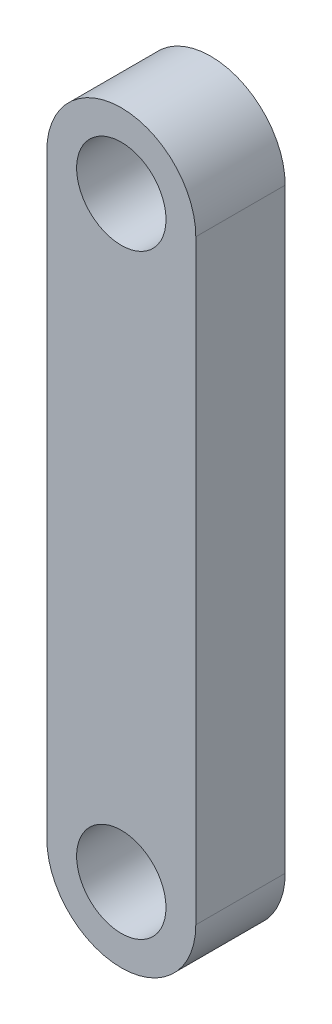
ISO-10303-21;
HEADER;
FILE_DESCRIPTION(('STEP AP214'),'2;1');
FILE_NAME('part.step','',(''),(''),'','','');
FILE_SCHEMA(('AUTOMOTIVE_DESIGN { 1 0 10303 214 1 1 1 1 }'));
ENDSEC;
DATA;
#1=APPLICATION_CONTEXT('core data for automotive mechanical design processes');
#2=APPLICATION_PROTOCOL_DEFINITION('international standard','automotive_design',2000,#1);
#3=PRODUCT_CONTEXT('',#1,'mechanical');
#4=PRODUCT('Part','Part','',(#3));
#5=PRODUCT_RELATED_PRODUCT_CATEGORY('part','',(#4));
#6=PRODUCT_DEFINITION_FORMATION('','',#4);
#7=PRODUCT_DEFINITION_CONTEXT('part definition',#1,'design');
#8=PRODUCT_DEFINITION('design','',#6,#7);
#9=PRODUCT_DEFINITION_SHAPE('','',#8);
#10=(LENGTH_UNIT() NAMED_UNIT(*) SI_UNIT(.MILLI.,.METRE.));
#11=(NAMED_UNIT(*) PLANE_ANGLE_UNIT() SI_UNIT($,.RADIAN.));
#12=(NAMED_UNIT(*) SI_UNIT($,.STERADIAN.) SOLID_ANGLE_UNIT());
#13=UNCERTAINTY_MEASURE_WITH_UNIT(LENGTH_MEASURE(1.E-05),#10,'distance_accuracy_value','');
#14=(GEOMETRIC_REPRESENTATION_CONTEXT(3) GLOBAL_UNCERTAINTY_ASSIGNED_CONTEXT((#13)) GLOBAL_UNIT_ASSIGNED_CONTEXT((#10,
#11,#12)) REPRESENTATION_CONTEXT('',''));
#15=CARTESIAN_POINT('',(0.,0.,0.));
#16=DIRECTION('',(0.,0.,1.));
#17=DIRECTION('',(1.,0.,0.));
#18=AXIS2_PLACEMENT_3D('',#15,#16,#17);
#19=CARTESIAN_POINT('',(0.,-50.,15.));
#20=DIRECTION('',(0.,0.,1.));
#21=DIRECTION('',(1.,0.,0.));
#22=AXIS2_PLACEMENT_3D('',#19,#20,#21);
#23=PLANE('',#22);
#24=CARTESIAN_POINT('',(0.,50.,15.));
#25=DIRECTION('',(0.,0.,1.));
#26=DIRECTION('',(1.,0.,0.));
#27=AXIS2_PLACEMENT_3D('',#24,#25,#26);
#28=CIRCLE('',#27,7.5);
#29=CARTESIAN_POINT('',(7.49999999999999,50.,15.));
#30=VERTEX_POINT('',#29);
#31=EDGE_CURVE('E99',#30,#30,#28,.T.);
#32=ORIENTED_EDGE('',*,*,#31,.F.);
#33=EDGE_LOOP('',(#32));
#34=FACE_BOUND('',#33,.T.);
#35=CARTESIAN_POINT('',(0.,-50.,15.));
#36=DIRECTION('',(0.,0.,1.));
#37=DIRECTION('',(1.,0.,0.));
#38=AXIS2_PLACEMENT_3D('',#35,#36,#37);
#39=CIRCLE('',#38,12.5);
#40=CARTESIAN_POINT('',(-12.5,-50.,15.));
#41=VERTEX_POINT('',#40);
#42=CARTESIAN_POINT('',(12.5,-50.,15.));
#43=VERTEX_POINT('',#42);
#44=EDGE_CURVE('E84',#41,#43,#39,.T.);
#45=ORIENTED_EDGE('',*,*,#44,.T.);
#46=DIRECTION('',(0.,1.,0.));
#47=VECTOR('',#46,1.);
#48=CARTESIAN_POINT('',(12.5,-50.,15.));
#49=LINE('',#48,#47);
#50=CARTESIAN_POINT('',(12.5,50.,15.));
#51=VERTEX_POINT('',#50);
#52=EDGE_CURVE('E79',#43,#51,#49,.T.);
#53=ORIENTED_EDGE('',*,*,#52,.T.);
#54=CARTESIAN_POINT('',(0.,50.,15.));
#55=DIRECTION('',(0.,0.,1.));
#56=DIRECTION('',(1.,0.,0.));
#57=AXIS2_PLACEMENT_3D('',#54,#55,#56);
#58=CIRCLE('',#57,12.5);
#59=CARTESIAN_POINT('',(-12.5,50.,15.));
#60=VERTEX_POINT('',#59);
#61=EDGE_CURVE('E82',#51,#60,#58,.T.);
#62=ORIENTED_EDGE('',*,*,#61,.T.);
#63=DIRECTION('',(0.,-1.,0.));
#64=VECTOR('',#63,1.);
#65=CARTESIAN_POINT('',(-12.5,-50.,15.));
#66=LINE('',#65,#64);
#67=EDGE_CURVE('E49',#60,#41,#66,.T.);
#68=ORIENTED_EDGE('',*,*,#67,.T.);
#69=EDGE_LOOP('',(#45,#53,#62,#68));
#70=FACE_BOUND('',#69,.T.);
#71=CARTESIAN_POINT('',(0.,-50.,15.));
#72=DIRECTION('',(0.,0.,1.));
#73=DIRECTION('',(1.,0.,0.));
#74=AXIS2_PLACEMENT_3D('',#71,#72,#73);
#75=CIRCLE('',#74,7.5);
#76=CARTESIAN_POINT('',(7.5,-50.,15.));
#77=VERTEX_POINT('',#76);
#78=EDGE_CURVE('E114',#77,#77,#75,.T.);
#79=ORIENTED_EDGE('',*,*,#78,.F.);
#80=EDGE_LOOP('',(#79));
#81=FACE_BOUND('',#80,.T.);
#82=ADVANCED_FACE('F32',(#34,#70,#81),#23,.T.);
#83=CARTESIAN_POINT('',(0.,-50.,0.));
#84=DIRECTION('',(0.,0.,1.));
#85=DIRECTION('',(1.,0.,0.));
#86=AXIS2_PLACEMENT_3D('',#83,#84,#85);
#87=PLANE('',#86);
#88=CARTESIAN_POINT('',(0.,50.,0.));
#89=DIRECTION('',(0.,0.,1.));
#90=DIRECTION('',(1.,0.,0.));
#91=AXIS2_PLACEMENT_3D('',#88,#89,#90);
#92=CIRCLE('',#91,7.5);
#93=CARTESIAN_POINT('',(7.49999999999999,50.,0.));
#94=VERTEX_POINT('',#93);
#95=EDGE_CURVE('E111',#94,#94,#92,.T.);
#96=ORIENTED_EDGE('',*,*,#95,.T.);
#97=EDGE_LOOP('',(#96));
#98=FACE_BOUND('',#97,.T.);
#99=CARTESIAN_POINT('',(0.,-50.,0.));
#100=DIRECTION('',(0.,0.,1.));
#101=DIRECTION('',(1.,0.,0.));
#102=AXIS2_PLACEMENT_3D('',#99,#100,#101);
#103=CIRCLE('',#102,12.5);
#104=CARTESIAN_POINT('',(-12.5,-50.,0.));
#105=VERTEX_POINT('',#104);
#106=CARTESIAN_POINT('',(12.5,-50.,0.));
#107=VERTEX_POINT('',#106);
#108=EDGE_CURVE('E96',#105,#107,#103,.T.);
#109=ORIENTED_EDGE('',*,*,#108,.F.);
#110=DIRECTION('',(0.,-1.,0.));
#111=VECTOR('',#110,1.);
#112=CARTESIAN_POINT('',(-12.5,-50.,0.));
#113=LINE('',#112,#111);
#114=CARTESIAN_POINT('',(-12.5,50.,0.));
#115=VERTEX_POINT('',#114);
#116=EDGE_CURVE('E72',#115,#105,#113,.T.);
#117=ORIENTED_EDGE('',*,*,#116,.F.);
#118=CARTESIAN_POINT('',(0.,50.,0.));
#119=DIRECTION('',(0.,0.,1.));
#120=DIRECTION('',(1.,0.,0.));
#121=AXIS2_PLACEMENT_3D('',#118,#119,#120);
#122=CIRCLE('',#121,12.5);
#123=CARTESIAN_POINT('',(12.5,50.,0.));
#124=VERTEX_POINT('',#123);
#125=EDGE_CURVE('E66',#124,#115,#122,.T.);
#126=ORIENTED_EDGE('',*,*,#125,.F.);
#127=DIRECTION('',(0.,1.,0.));
#128=VECTOR('',#127,1.);
#129=CARTESIAN_POINT('',(12.5,-50.,0.));
#130=LINE('',#129,#128);
#131=EDGE_CURVE('E88',#107,#124,#130,.T.);
#132=ORIENTED_EDGE('',*,*,#131,.F.);
#133=EDGE_LOOP('',(#109,#117,#126,#132));
#134=FACE_BOUND('',#133,.T.);
#135=CARTESIAN_POINT('',(0.,-50.,0.));
#136=DIRECTION('',(0.,0.,1.));
#137=DIRECTION('',(1.,0.,0.));
#138=AXIS2_PLACEMENT_3D('',#135,#136,#137);
#139=CIRCLE('',#138,7.5);
#140=CARTESIAN_POINT('',(7.5,-50.,0.));
#141=VERTEX_POINT('',#140);
#142=EDGE_CURVE('E117',#141,#141,#139,.T.);
#143=ORIENTED_EDGE('',*,*,#142,.T.);
#144=EDGE_LOOP('',(#143));
#145=FACE_BOUND('',#144,.T.);
#146=ADVANCED_FACE('F107',(#98,#134,#145),#87,.F.);
#147=CARTESIAN_POINT('',(0.,-50.,15.));
#148=DIRECTION('',(0.,0.,-1.));
#149=DIRECTION('',(-1.,0.,0.));
#150=AXIS2_PLACEMENT_3D('',#147,#148,#149);
#151=CYLINDRICAL_SURFACE('',#150,12.5);
#152=ORIENTED_EDGE('',*,*,#108,.T.);
#153=DIRECTION('',(0.,0.,-1.));
#154=VECTOR('',#153,1.);
#155=CARTESIAN_POINT('',(12.5,-50.,15.));
#156=LINE('',#155,#154);
#157=EDGE_CURVE('E11',#43,#107,#156,.T.);
#158=ORIENTED_EDGE('',*,*,#157,.F.);
#159=ORIENTED_EDGE('',*,*,#44,.F.);
#160=DIRECTION('',(0.,0.,-1.));
#161=VECTOR('',#160,1.);
#162=CARTESIAN_POINT('',(-12.5,-50.,15.));
#163=LINE('',#162,#161);
#164=EDGE_CURVE('E92',#41,#105,#163,.T.);
#165=ORIENTED_EDGE('',*,*,#164,.T.);
#166=EDGE_LOOP('',(#152,#158,#159,#165));
#167=FACE_BOUND('',#166,.T.);
#168=ADVANCED_FACE('F34',(#167),#151,.T.);
#169=CARTESIAN_POINT('',(12.5,-50.,15.));
#170=DIRECTION('',(-1.,0.,0.));
#171=DIRECTION('',(0.,-1.,0.));
#172=AXIS2_PLACEMENT_3D('',#169,#170,#171);
#173=PLANE('',#172);
#174=ORIENTED_EDGE('',*,*,#131,.T.);
#175=DIRECTION('',(0.,0.,-1.));
#176=VECTOR('',#175,1.);
#177=CARTESIAN_POINT('',(12.5,50.,15.));
#178=LINE('',#177,#176);
#179=EDGE_CURVE('E41',#51,#124,#178,.T.);
#180=ORIENTED_EDGE('',*,*,#179,.F.);
#181=ORIENTED_EDGE('',*,*,#52,.F.);
#182=ORIENTED_EDGE('',*,*,#157,.T.);
#183=EDGE_LOOP('',(#174,#180,#181,#182));
#184=FACE_BOUND('',#183,.T.);
#185=ADVANCED_FACE('F87',(#184),#173,.F.);
#186=CARTESIAN_POINT('',(0.,50.,15.));
#187=DIRECTION('',(0.,0.,-1.));
#188=DIRECTION('',(-1.,0.,0.));
#189=AXIS2_PLACEMENT_3D('',#186,#187,#188);
#190=CYLINDRICAL_SURFACE('',#189,12.5);
#191=ORIENTED_EDGE('',*,*,#125,.T.);
#192=DIRECTION('',(0.,0.,-1.));
#193=VECTOR('',#192,1.);
#194=CARTESIAN_POINT('',(-12.5,50.,15.));
#195=LINE('',#194,#193);
#196=EDGE_CURVE('E89',#60,#115,#195,.T.);
#197=ORIENTED_EDGE('',*,*,#196,.F.);
#198=ORIENTED_EDGE('',*,*,#61,.F.);
#199=ORIENTED_EDGE('',*,*,#179,.T.);
#200=EDGE_LOOP('',(#191,#197,#198,#199));
#201=FACE_BOUND('',#200,.T.);
#202=ADVANCED_FACE('F90',(#201),#190,.T.);
#203=CARTESIAN_POINT('',(-12.5,-50.,15.));
#204=DIRECTION('',(1.,0.,0.));
#205=DIRECTION('',(0.,1.,0.));
#206=AXIS2_PLACEMENT_3D('',#203,#204,#205);
#207=PLANE('',#206);
#208=ORIENTED_EDGE('',*,*,#116,.T.);
#209=ORIENTED_EDGE('',*,*,#164,.F.);
#210=ORIENTED_EDGE('',*,*,#67,.F.);
#211=ORIENTED_EDGE('',*,*,#196,.T.);
#212=EDGE_LOOP('',(#208,#209,#210,#211));
#213=FACE_BOUND('',#212,.T.);
#214=ADVANCED_FACE('F104',(#213),#207,.F.);
#215=CARTESIAN_POINT('',(0.,50.,15.));
#216=DIRECTION('',(0.,0.,-1.));
#217=DIRECTION('',(-1.,0.,0.));
#218=AXIS2_PLACEMENT_3D('',#215,#216,#217);
#219=CYLINDRICAL_SURFACE('',#218,7.5);
#220=ORIENTED_EDGE('',*,*,#31,.T.);
#221=EDGE_LOOP('',(#220));
#222=FACE_BOUND('',#221,.T.);
#223=ORIENTED_EDGE('',*,*,#95,.F.);
#224=EDGE_LOOP('',(#223));
#225=FACE_BOUND('',#224,.T.);
#226=ADVANCED_FACE('F135',(#222,#225),#219,.F.);
#227=CARTESIAN_POINT('',(0.,-50.,15.));
#228=DIRECTION('',(0.,0.,-1.));
#229=DIRECTION('',(-1.,0.,0.));
#230=AXIS2_PLACEMENT_3D('',#227,#228,#229);
#231=CYLINDRICAL_SURFACE('',#230,7.5);
#232=ORIENTED_EDGE('',*,*,#78,.T.);
#233=EDGE_LOOP('',(#232));
#234=FACE_BOUND('',#233,.T.);
#235=ORIENTED_EDGE('',*,*,#142,.F.);
#236=EDGE_LOOP('',(#235));
#237=FACE_BOUND('',#236,.T.);
#238=ADVANCED_FACE('F123',(#234,#237),#231,.F.);
#239=CLOSED_SHELL('',(#82,#146,#168,#185,#202,#214,#226,#238));
#240=MANIFOLD_SOLID_BREP('B2',#239);
#241=ADVANCED_BREP_SHAPE_REPRESENTATION('',(#18,#240),#14);
#242=SHAPE_DEFINITION_REPRESENTATION(#9,#241);
ENDSEC;
END-ISO-10303-21;
